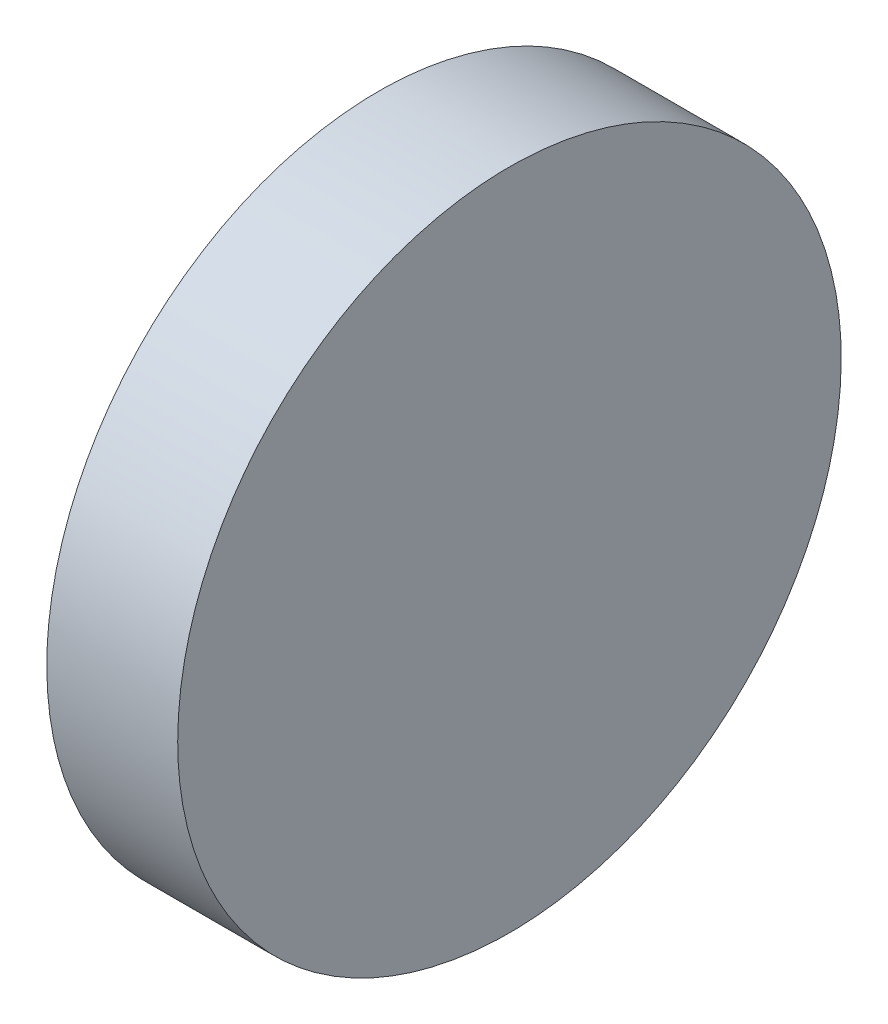
ISO-10303-21;
HEADER;
FILE_DESCRIPTION(('STEP AP214'),'2;1');
FILE_NAME('part.step','',(''),(''),'','','');
FILE_SCHEMA(('AUTOMOTIVE_DESIGN { 1 0 10303 214 1 1 1 1 }'));
ENDSEC;
DATA;
#1=APPLICATION_CONTEXT('core data for automotive mechanical design processes');
#2=APPLICATION_PROTOCOL_DEFINITION('international standard','automotive_design',2000,#1);
#3=PRODUCT_CONTEXT('',#1,'mechanical');
#4=PRODUCT('Part','Part','',(#3));
#5=PRODUCT_RELATED_PRODUCT_CATEGORY('part','',(#4));
#6=PRODUCT_DEFINITION_FORMATION('','',#4);
#7=PRODUCT_DEFINITION_CONTEXT('part definition',#1,'design');
#8=PRODUCT_DEFINITION('design','',#6,#7);
#9=PRODUCT_DEFINITION_SHAPE('','',#8);
#10=(LENGTH_UNIT() NAMED_UNIT(*) SI_UNIT(.MILLI.,.METRE.));
#11=(NAMED_UNIT(*) PLANE_ANGLE_UNIT() SI_UNIT($,.RADIAN.));
#12=(NAMED_UNIT(*) SI_UNIT($,.STERADIAN.) SOLID_ANGLE_UNIT());
#13=UNCERTAINTY_MEASURE_WITH_UNIT(LENGTH_MEASURE(1.E-05),#10,'distance_accuracy_value','');
#14=(GEOMETRIC_REPRESENTATION_CONTEXT(3) GLOBAL_UNCERTAINTY_ASSIGNED_CONTEXT((#13)) GLOBAL_UNIT_ASSIGNED_CONTEXT((#10,
#11,#12)) REPRESENTATION_CONTEXT('',''));
#15=CARTESIAN_POINT('',(0.,0.,0.));
#16=DIRECTION('',(0.,0.,1.));
#17=DIRECTION('',(1.,0.,0.));
#18=AXIS2_PLACEMENT_3D('',#15,#16,#17);
#19=CARTESIAN_POINT('',(25.7111386377281,12.7,-10.2005025253169));
#20=CARTESIAN_POINT('',(25.7111386377281,12.9355219708907,-10.2005025253169));
#21=CARTESIAN_POINT('',(25.7111386377281,13.4065659126721,-10.2941989909165));
#22=CARTESIAN_POINT('',(25.7111386377281,14.0055635701758,-10.6944364298242));
#23=CARTESIAN_POINT('',(25.7111386377281,14.4058010090835,-11.2934340873279));
#24=CARTESIAN_POINT('',(25.7111386377281,14.5463457074828,-12.));
#25=CARTESIAN_POINT('',(25.7111386377281,14.4058010090835,-12.7065659126721));
#26=CARTESIAN_POINT('',(25.7111386377281,14.0055635701758,-13.3055635701758));
#27=CARTESIAN_POINT('',(25.7111386377281,13.4065659126721,-13.7058010090835));
#28=CARTESIAN_POINT('',(25.7111386377281,12.7,-13.8463457074828));
#29=CARTESIAN_POINT('',(25.7111386377281,11.9934340873279,-13.7058010090835));
#30=CARTESIAN_POINT('',(25.7111386377281,11.3944364298242,-13.3055635701758));
#31=CARTESIAN_POINT('',(25.7111386377281,10.9941989909165,-12.7065659126721));
#32=CARTESIAN_POINT('',(25.7111386377281,10.8536542925172,-12.));
#33=CARTESIAN_POINT('',(25.7111386377281,10.9941989909165,-11.2934340873279));
#34=CARTESIAN_POINT('',(25.7111386377281,11.3944364298242,-10.6944364298242));
#35=CARTESIAN_POINT('',(25.7111386377281,11.9934340873279,-10.2941989909165));
#36=CARTESIAN_POINT('',(25.7111386377281,12.4644780291093,-10.2005025253169));
#37=CARTESIAN_POINT('',(25.7111386377281,12.7,-10.2005025253169));
#38=B_SPLINE_CURVE_WITH_KNOTS('',3,(#19,#20,#21,#22,#23,#24,#25,#26,#27,#28,#29,#30,#31,#32,#33,
#34,#35,#36,#37),.UNSPECIFIED.,.T.,.F.,(4,1,1,1,1,1,1,1,1,1,1,1,1,1,1,1,4),(0.,
0.0624999999999998,0.125,0.1875,0.25,0.3125,0.375,0.4375,0.5,0.5625,0.625,0.6875,0.75,0.8125,
0.875,0.9375,1.),.UNSPECIFIED.);
#39=DIRECTION('',(-1.,0.,0.));
#40=VECTOR('',#39,1.);
#41=SURFACE_OF_LINEAR_EXTRUSION('',#38,#40);
#42=CARTESIAN_POINT('',(25.7111386377281,12.7,-10.2005025253169));
#43=CARTESIAN_POINT('',(25.7111386377281,12.9355219708907,-10.2005025253169));
#44=CARTESIAN_POINT('',(25.7111386377281,13.4065659126721,-10.2941989909165));
#45=CARTESIAN_POINT('',(25.7111386377281,14.0055635701758,-10.6944364298242));
#46=CARTESIAN_POINT('',(25.7111386377281,14.4058010090835,-11.2934340873279));
#47=CARTESIAN_POINT('',(25.7111386377281,14.5463457074828,-12.));
#48=CARTESIAN_POINT('',(25.7111386377281,14.4058010090835,-12.7065659126721));
#49=CARTESIAN_POINT('',(25.7111386377281,14.0055635701758,-13.3055635701758));
#50=CARTESIAN_POINT('',(25.7111386377281,13.4065659126721,-13.7058010090835));
#51=CARTESIAN_POINT('',(25.7111386377281,12.7,-13.8463457074828));
#52=CARTESIAN_POINT('',(25.7111386377281,11.9934340873279,-13.7058010090835));
#53=CARTESIAN_POINT('',(25.7111386377281,11.3944364298242,-13.3055635701758));
#54=CARTESIAN_POINT('',(25.7111386377281,10.9941989909165,-12.7065659126721));
#55=CARTESIAN_POINT('',(25.7111386377281,10.8536542925172,-12.));
#56=CARTESIAN_POINT('',(25.7111386377281,10.9941989909165,-11.2934340873279));
#57=CARTESIAN_POINT('',(25.7111386377281,11.3944364298242,-10.6944364298242));
#58=CARTESIAN_POINT('',(25.7111386377281,11.9934340873279,-10.2941989909165));
#59=CARTESIAN_POINT('',(25.7111386377281,12.4644780291093,-10.2005025253169));
#60=CARTESIAN_POINT('',(25.7111386377281,12.7,-10.2005025253169));
#61=B_SPLINE_CURVE_WITH_KNOTS('',3,(#42,#43,#44,#45,#46,#47,#48,#49,#50,#51,#52,#53,#54,#55,#56,
#57,#58,#59,#60),.UNSPECIFIED.,.T.,.F.,(4,1,1,1,1,1,1,1,1,1,1,1,1,1,1,1,4),(0.,
0.0624999999999998,0.125,0.1875,0.25,0.3125,0.375,0.4375,0.5,0.5625,0.625,0.6875,0.75,0.8125,
0.875,0.9375,1.),.UNSPECIFIED.);
#62=CARTESIAN_POINT('',(25.7111386377281,12.7,-10.2005025253169));
#63=VERTEX_POINT('',#62);
#64=EDGE_CURVE('E9',#63,#63,#61,.T.);
#65=ORIENTED_EDGE('',*,*,#64,.T.);
#66=EDGE_LOOP('',(#65));
#67=FACE_BOUND('',#66,.T.);
#68=CARTESIAN_POINT('',(25.001,12.7,-10.2005025253169));
#69=CARTESIAN_POINT('',(25.001,12.6705590589749,-10.200502504003));
#70=CARTESIAN_POINT('',(25.001,12.6411187290328,-10.2012345609489));
#71=CARTESIAN_POINT('',(25.001,12.582308094268,-10.2041486671153));
#72=CARTESIAN_POINT('',(25.001,12.552937793667,-10.2063308016405));
#73=CARTESIAN_POINT('',(25.001,12.4943374905285,-10.212131094405));
#74=CARTESIAN_POINT('',(25.001,12.465107497758,-10.2157493511882));
#75=CARTESIAN_POINT('',(25.001,12.406857659743,-10.2244079695056));
#76=CARTESIAN_POINT('',(25.001,12.3778378236172,-10.2294483923733));
#77=CARTESIAN_POINT('',(25.001,12.3200782743428,-10.2409374801148));
#78=CARTESIAN_POINT('',(25.001,12.2913385611941,-10.2473861449885));
#79=CARTESIAN_POINT('',(25.001,12.2342092070471,-10.2616778787043));
#80=CARTESIAN_POINT('',(25.001,12.2058195510031,-10.2695208873915));
#81=CARTESIAN_POINT('',(25.001,12.1494602997703,-10.2865874585324));
#82=CARTESIAN_POINT('',(25.001,12.1214906758886,-10.2958109262084));
#83=CARTESIAN_POINT('',(25.001,12.0660413837378,-10.315624581653));
#84=CARTESIAN_POINT('',(25.001,12.0385616867419,-10.3262146889863));
#85=CARTESIAN_POINT('',(25.001,11.9841625729701,-10.3487475396828));
#86=CARTESIAN_POINT('',(25.001,11.9572431561942,-10.3606902830459));
#87=CARTESIAN_POINT('',(25.001,11.904024215536,-10.3858884834655));
#88=CARTESIAN_POINT('',(25.001,11.8777247282169,-10.3991440177113));
#89=CARTESIAN_POINT('',(25.001,11.8258048314745,-10.4269281380594));
#90=CARTESIAN_POINT('',(25.001,11.8001844687801,-10.4414568114685));
#91=CARTESIAN_POINT('',(25.001,11.7496821325853,-10.4717475840963));
#92=CARTESIAN_POINT('',(25.001,11.7248001909819,-10.4875097364898));
#93=CARTESIAN_POINT('',(25.001,11.6758340125771,-10.5202278908803));
#94=CARTESIAN_POINT('',(25.001,11.6517497757758,-10.5371838928774));
#95=CARTESIAN_POINT('',(25.001,11.6044383435635,-10.5722501907939));
#96=CARTESIAN_POINT('',(25.001,11.5812111112317,-10.5903604368953));
#97=CARTESIAN_POINT('',(25.001,11.5356730468204,-10.6276956442844));
#98=CARTESIAN_POINT('',(25.001,11.513362151962,-10.6469205289893));
#99=CARTESIAN_POINT('',(25.001,11.4697160434587,-10.6864454851841));
#100=CARTESIAN_POINT('',(25.001,11.4483807724922,-10.7067454933549));
#101=CARTESIAN_POINT('',(25.001,11.4067454933549,-10.7483807724922));
#102=CARTESIAN_POINT('',(25.001,11.3864454851841,-10.7697160434587));
#103=CARTESIAN_POINT('',(25.001,11.3469205289893,-10.813362151962));
#104=CARTESIAN_POINT('',(25.001,11.3276956442844,-10.8356730468204));
#105=CARTESIAN_POINT('',(25.001,11.2903604368953,-10.8812111112317));
#106=CARTESIAN_POINT('',(25.001,11.2722501907939,-10.9044383435635));
#107=CARTESIAN_POINT('',(25.001,11.2371838928774,-10.9517497757758));
#108=CARTESIAN_POINT('',(25.001,11.2202278908803,-10.9758340125772));
#109=CARTESIAN_POINT('',(25.001,11.1875097364898,-11.0248001909818));
#110=CARTESIAN_POINT('',(25.001,11.1717475840963,-11.0496821325851));
#111=CARTESIAN_POINT('',(25.001,11.1414568114685,-11.1001844687803));
#112=CARTESIAN_POINT('',(25.001,11.1269281380594,-11.1258048314752));
#113=CARTESIAN_POINT('',(25.001,11.0991440177113,-11.1777247282162));
#114=CARTESIAN_POINT('',(25.001,11.0858884834653,-11.2040242155335));
#115=CARTESIAN_POINT('',(25.001,11.060690283046,-11.2572431561967));
#116=CARTESIAN_POINT('',(25.001,11.0487475396834,-11.2841625729794));
#117=CARTESIAN_POINT('',(25.001,11.0262146889858,-11.3385616867325));
#118=CARTESIAN_POINT('',(25.001,11.0156245816508,-11.3660413837029));
#119=CARTESIAN_POINT('',(25.001,10.9958109262105,-11.4214906759236));
#120=CARTESIAN_POINT('',(25.001,10.9865874585403,-11.4494602999009));
#121=CARTESIAN_POINT('',(25.001,10.9695208873836,-11.5058195508725));
#122=CARTESIAN_POINT('',(25.001,10.9616778786748,-11.5342092065597));
#123=CARTESIAN_POINT('',(25.001,10.947386145018,-11.5913385616815));
#124=CARTESIAN_POINT('',(25.001,10.9409374802247,-11.6200782761619));
#125=CARTESIAN_POINT('',(25.001,10.9294483922634,-11.6778378217981));
#126=CARTESIAN_POINT('',(25.001,10.9244079690954,-11.7068576529539));
#127=CARTESIAN_POINT('',(25.001,10.9157493515983,-11.7651075045468));
#128=CARTESIAN_POINT('',(25.001,10.9121310959356,-11.794337515864));
#129=CARTESIAN_POINT('',(25.001,10.9063308001101,-11.8529377683333));
#130=CARTESIAN_POINT('',(25.001,10.9041486614037,-11.8823079997243));
#131=CARTESIAN_POINT('',(25.001,10.9012345666601,-11.9411188235709));
#132=CARTESIAN_POINT('',(25.001,10.9005025253169,-11.9705594117854));
#133=CARTESIAN_POINT('',(25.001,10.9005025253169,-12.0294405882146));
#134=CARTESIAN_POINT('',(25.001,10.9012345666601,-12.0588811764291));
#135=CARTESIAN_POINT('',(25.001,10.9041486614037,-12.1176920002757));
#136=CARTESIAN_POINT('',(25.001,10.9063308001101,-12.1470622316667));
#137=CARTESIAN_POINT('',(25.001,10.9121310959356,-12.205662484136));
#138=CARTESIAN_POINT('',(25.001,10.9157493515983,-12.2348924954532));
#139=CARTESIAN_POINT('',(25.001,10.9244079690954,-12.2931423470461));
#140=CARTESIAN_POINT('',(25.001,10.9294483922634,-12.3221621782019));
#141=CARTESIAN_POINT('',(25.001,10.9409374802247,-12.3799217238381));
#142=CARTESIAN_POINT('',(25.001,10.947386145018,-12.4086614383185));
#143=CARTESIAN_POINT('',(25.001,10.9616778786748,-12.4657907934403));
#144=CARTESIAN_POINT('',(25.001,10.9695208873836,-12.4941804491275));
#145=CARTESIAN_POINT('',(25.001,10.9865874585403,-12.5505397000991));
#146=CARTESIAN_POINT('',(25.001,10.9958109262105,-12.5785093240764));
#147=CARTESIAN_POINT('',(25.001,11.0156245816508,-12.6339586162971));
#148=CARTESIAN_POINT('',(25.001,11.0262146889858,-12.6614383132675));
#149=CARTESIAN_POINT('',(25.001,11.0487475396834,-12.7158374270206));
#150=CARTESIAN_POINT('',(25.001,11.060690283046,-12.7427568438033));
#151=CARTESIAN_POINT('',(25.001,11.0858884834653,-12.7959757844665));
#152=CARTESIAN_POINT('',(25.001,11.0991440177113,-12.8222752717838));
#153=CARTESIAN_POINT('',(25.001,11.1269281380594,-12.8741951685248));
#154=CARTESIAN_POINT('',(25.001,11.1414568114685,-12.8998155312197));
#155=CARTESIAN_POINT('',(25.001,11.1717475840963,-12.9503178674149));
#156=CARTESIAN_POINT('',(25.001,11.1875097364898,-12.9751998090182));
#157=CARTESIAN_POINT('',(25.001,11.2202278908803,-13.0241659874228));
#158=CARTESIAN_POINT('',(25.001,11.2371838928774,-13.0482502242242));
#159=CARTESIAN_POINT('',(25.001,11.2722501907939,-13.0955616564365));
#160=CARTESIAN_POINT('',(25.001,11.2903604368953,-13.1187888887683));
#161=CARTESIAN_POINT('',(25.001,11.3276956442844,-13.1643269531796));
#162=CARTESIAN_POINT('',(25.001,11.3469205289893,-13.186637848038));
#163=CARTESIAN_POINT('',(25.001,11.3864454851841,-13.2302839565413));
#164=CARTESIAN_POINT('',(25.001,11.4067454933549,-13.2516192275078));
#165=CARTESIAN_POINT('',(25.001,11.4483807724922,-13.2932545066451));
#166=CARTESIAN_POINT('',(25.001,11.4697160434587,-13.3135545148159));
#167=CARTESIAN_POINT('',(25.001,11.513362151962,-13.3530794710107));
#168=CARTESIAN_POINT('',(25.001,11.5356730468204,-13.3723043557156));
#169=CARTESIAN_POINT('',(25.001,11.5812111112317,-13.4096395631047));
#170=CARTESIAN_POINT('',(25.001,11.6044383435635,-13.4277498092061));
#171=CARTESIAN_POINT('',(25.001,11.6517497757758,-13.4628161071226));
#172=CARTESIAN_POINT('',(25.001,11.6758340125772,-13.4797721091197));
#173=CARTESIAN_POINT('',(25.001,11.7248001909818,-13.5124902635102));
#174=CARTESIAN_POINT('',(25.001,11.7496821325851,-13.5282524159037));
#175=CARTESIAN_POINT('',(25.001,11.8001844687803,-13.5585431885315));
#176=CARTESIAN_POINT('',(25.001,11.8258048314752,-13.5730718619406));
#177=CARTESIAN_POINT('',(25.001,11.8777247282162,-13.6008559822887));
#178=CARTESIAN_POINT('',(25.001,11.9040242155335,-13.6141115165347));
#179=CARTESIAN_POINT('',(25.001,11.9572431561967,-13.639309716954));
#180=CARTESIAN_POINT('',(25.001,11.9841625729794,-13.6512524603166));
#181=CARTESIAN_POINT('',(25.001,12.0385616867325,-13.6737853110142));
#182=CARTESIAN_POINT('',(25.001,12.0660413837029,-13.6843754183492));
#183=CARTESIAN_POINT('',(25.001,12.1214906759236,-13.7041890737895));
#184=CARTESIAN_POINT('',(25.001,12.1494602999009,-13.7134125414597));
#185=CARTESIAN_POINT('',(25.001,12.2058195508725,-13.7304791126164));
#186=CARTESIAN_POINT('',(25.001,12.2342092065597,-13.7383221213252));
#187=CARTESIAN_POINT('',(25.001,12.2913385616815,-13.752613854982));
#188=CARTESIAN_POINT('',(25.001,12.3200782761619,-13.7590625197753));
#189=CARTESIAN_POINT('',(25.001,12.3778378217981,-13.7705516077366));
#190=CARTESIAN_POINT('',(25.001,12.4068576529539,-13.7755920309046));
#191=CARTESIAN_POINT('',(25.001,12.4651075045468,-13.7842506484017));
#192=CARTESIAN_POINT('',(25.001,12.494337515864,-13.7878689040644));
#193=CARTESIAN_POINT('',(25.001,12.5529377683333,-13.7936691998899));
#194=CARTESIAN_POINT('',(25.001,12.5823079997243,-13.7958513385963));
#195=CARTESIAN_POINT('',(25.001,12.6411188235709,-13.7987654333399));
#196=CARTESIAN_POINT('',(25.001,12.6705594117854,-13.7994974746831));
#197=CARTESIAN_POINT('',(25.001,12.7294405882146,-13.7994974746831));
#198=CARTESIAN_POINT('',(25.001,12.7588811764291,-13.7987654333399));
#199=CARTESIAN_POINT('',(25.001,12.8176920002757,-13.7958513385963));
#200=CARTESIAN_POINT('',(25.001,12.8470622316667,-13.7936691998899));
#201=CARTESIAN_POINT('',(25.001,12.905662484136,-13.7878689040644));
#202=CARTESIAN_POINT('',(25.001,12.9348924954532,-13.7842506484017));
#203=CARTESIAN_POINT('',(25.001,12.9931423470461,-13.7755920309046));
#204=CARTESIAN_POINT('',(25.001,13.0221621782019,-13.7705516077366));
#205=CARTESIAN_POINT('',(25.001,13.0799217238381,-13.7590625197753));
#206=CARTESIAN_POINT('',(25.001,13.1086614383184,-13.752613854982));
#207=CARTESIAN_POINT('',(25.001,13.1657907934403,-13.7383221213252));
#208=CARTESIAN_POINT('',(25.001,13.1941804491275,-13.7304791126164));
#209=CARTESIAN_POINT('',(25.001,13.2505397000991,-13.7134125414597));
#210=CARTESIAN_POINT('',(25.001,13.2785093240764,-13.7041890737895));
#211=CARTESIAN_POINT('',(25.001,13.3339586162971,-13.6843754183492));
#212=CARTESIAN_POINT('',(25.001,13.3614383132675,-13.6737853110142));
#213=CARTESIAN_POINT('',(25.001,13.4158374270206,-13.6512524603166));
#214=CARTESIAN_POINT('',(25.001,13.4427568438033,-13.639309716954));
#215=CARTESIAN_POINT('',(25.001,13.4959757844665,-13.6141115165347));
#216=CARTESIAN_POINT('',(25.001,13.5222752717838,-13.6008559822887));
#217=CARTESIAN_POINT('',(25.001,13.5741951685248,-13.5730718619406));
#218=CARTESIAN_POINT('',(25.001,13.5998155312197,-13.5585431885315));
#219=CARTESIAN_POINT('',(25.001,13.6503178674149,-13.5282524159037));
#220=CARTESIAN_POINT('',(25.001,13.6751998090182,-13.5124902635102));
#221=CARTESIAN_POINT('',(25.001,13.7241659874228,-13.4797721091197));
#222=CARTESIAN_POINT('',(25.001,13.7482502242242,-13.4628161071226));
#223=CARTESIAN_POINT('',(25.001,13.7955616564365,-13.4277498092061));
#224=CARTESIAN_POINT('',(25.001,13.8187888887683,-13.4096395631047));
#225=CARTESIAN_POINT('',(25.001,13.8643269531796,-13.3723043557156));
#226=CARTESIAN_POINT('',(25.001,13.886637848038,-13.3530794710107));
#227=CARTESIAN_POINT('',(25.001,13.9302839565413,-13.3135545148159));
#228=CARTESIAN_POINT('',(25.001,13.9516192275078,-13.2932545066451));
#229=CARTESIAN_POINT('',(25.001,13.9932545066451,-13.2516192275078));
#230=CARTESIAN_POINT('',(25.001,14.0135545148159,-13.2302839565413));
#231=CARTESIAN_POINT('',(25.001,14.0530794710107,-13.186637848038));
#232=CARTESIAN_POINT('',(25.001,14.0723043557156,-13.1643269531796));
#233=CARTESIAN_POINT('',(25.001,14.1096395631047,-13.1187888887683));
#234=CARTESIAN_POINT('',(25.001,14.1277498092061,-13.0955616564365));
#235=CARTESIAN_POINT('',(25.001,14.1628161071226,-13.0482502242242));
#236=CARTESIAN_POINT('',(25.001,14.1797721091197,-13.0241659874228));
#237=CARTESIAN_POINT('',(25.001,14.2124902635102,-12.9751998090182));
#238=CARTESIAN_POINT('',(25.001,14.2282524159037,-12.9503178674149));
#239=CARTESIAN_POINT('',(25.001,14.2585431885315,-12.8998155312197));
#240=CARTESIAN_POINT('',(25.001,14.2730718619406,-12.8741951685248));
#241=CARTESIAN_POINT('',(25.001,14.3008559822887,-12.8222752717838));
#242=CARTESIAN_POINT('',(25.001,14.3141115165347,-12.7959757844665));
#243=CARTESIAN_POINT('',(25.001,14.339309716954,-12.7427568438033));
#244=CARTESIAN_POINT('',(25.001,14.3512524603166,-12.7158374270206));
#245=CARTESIAN_POINT('',(25.001,14.3737853110142,-12.6614383132675));
#246=CARTESIAN_POINT('',(25.001,14.3843754183492,-12.6339586162971));
#247=CARTESIAN_POINT('',(25.001,14.4041890737895,-12.5785093240764));
#248=CARTESIAN_POINT('',(25.001,14.4134125414597,-12.5505397000991));
#249=CARTESIAN_POINT('',(25.001,14.4304791126164,-12.4941804491275));
#250=CARTESIAN_POINT('',(25.001,14.4383221213252,-12.4657907934403));
#251=CARTESIAN_POINT('',(25.001,14.452613854982,-12.4086614383185));
#252=CARTESIAN_POINT('',(25.001,14.4590625197753,-12.3799217238381));
#253=CARTESIAN_POINT('',(25.001,14.4705516077366,-12.3221621782019));
#254=CARTESIAN_POINT('',(25.001,14.4755920309046,-12.2931423470461));
#255=CARTESIAN_POINT('',(25.001,14.4842506484017,-12.2348924954532));
#256=CARTESIAN_POINT('',(25.001,14.4878689040644,-12.205662484136));
#257=CARTESIAN_POINT('',(25.001,14.4936691998899,-12.1470622316667));
#258=CARTESIAN_POINT('',(25.001,14.4958513385963,-12.1176920002757));
#259=CARTESIAN_POINT('',(25.001,14.4987654333399,-12.0588811764291));
#260=CARTESIAN_POINT('',(25.001,14.4994974746831,-12.0294405882146));
#261=CARTESIAN_POINT('',(25.001,14.4994974746831,-11.9705594117854));
#262=CARTESIAN_POINT('',(25.001,14.4987654333399,-11.9411188235709));
#263=CARTESIAN_POINT('',(25.001,14.4958513385963,-11.8823079997243));
#264=CARTESIAN_POINT('',(25.001,14.4936691998899,-11.8529377683333));
#265=CARTESIAN_POINT('',(25.001,14.4878689040644,-11.794337515864));
#266=CARTESIAN_POINT('',(25.001,14.4842506484017,-11.7651075045468));
#267=CARTESIAN_POINT('',(25.001,14.4755920309046,-11.7068576529539));
#268=CARTESIAN_POINT('',(25.001,14.4705516077366,-11.6778378217981));
#269=CARTESIAN_POINT('',(25.001,14.4590625197753,-11.6200782761619));
#270=CARTESIAN_POINT('',(25.001,14.452613854982,-11.5913385616815));
#271=CARTESIAN_POINT('',(25.001,14.4383221213252,-11.5342092065597));
#272=CARTESIAN_POINT('',(25.001,14.4304791126164,-11.5058195508725));
#273=CARTESIAN_POINT('',(25.001,14.4134125414597,-11.4494602999009));
#274=CARTESIAN_POINT('',(25.001,14.4041890737895,-11.4214906759236));
#275=CARTESIAN_POINT('',(25.001,14.3843754183491,-11.3660413837029));
#276=CARTESIAN_POINT('',(25.001,14.3737853110142,-11.3385616867325));
#277=CARTESIAN_POINT('',(25.001,14.3512524603166,-11.2841625729794));
#278=CARTESIAN_POINT('',(25.001,14.339309716954,-11.2572431561967));
#279=CARTESIAN_POINT('',(25.001,14.3141115165347,-11.2040242155335));
#280=CARTESIAN_POINT('',(25.001,14.3008559822887,-11.1777247282162));
#281=CARTESIAN_POINT('',(25.001,14.2730718619406,-11.1258048314752));
#282=CARTESIAN_POINT('',(25.001,14.2585431885315,-11.1001844687803));
#283=CARTESIAN_POINT('',(25.001,14.2282524159037,-11.0496821325851));
#284=CARTESIAN_POINT('',(25.001,14.2124902635102,-11.0248001909818));
#285=CARTESIAN_POINT('',(25.001,14.1797721091197,-10.9758340125772));
#286=CARTESIAN_POINT('',(25.001,14.1628161071226,-10.9517497757758));
#287=CARTESIAN_POINT('',(25.001,14.1277498092061,-10.9044383435635));
#288=CARTESIAN_POINT('',(25.001,14.1096395631047,-10.8812111112317));
#289=CARTESIAN_POINT('',(25.001,14.0723043557156,-10.8356730468204));
#290=CARTESIAN_POINT('',(25.001,14.0530794710107,-10.813362151962));
#291=CARTESIAN_POINT('',(25.001,14.0135545148159,-10.7697160434587));
#292=CARTESIAN_POINT('',(25.001,13.9932545066451,-10.7483807724922));
#293=CARTESIAN_POINT('',(25.001,13.9516192275078,-10.7067454933549));
#294=CARTESIAN_POINT('',(25.001,13.9302839565413,-10.6864454851841));
#295=CARTESIAN_POINT('',(25.001,13.886637848038,-10.6469205289893));
#296=CARTESIAN_POINT('',(25.001,13.8643269531796,-10.6276956442844));
#297=CARTESIAN_POINT('',(25.001,13.8187888887683,-10.5903604368953));
#298=CARTESIAN_POINT('',(25.001,13.7955616564365,-10.5722501907939));
#299=CARTESIAN_POINT('',(25.001,13.7482502242242,-10.5371838928774));
#300=CARTESIAN_POINT('',(25.001,13.7241659874229,-10.5202278908803));
#301=CARTESIAN_POINT('',(25.001,13.6751998090181,-10.4875097364898));
#302=CARTESIAN_POINT('',(25.001,13.6503178674147,-10.4717475840963));
#303=CARTESIAN_POINT('',(25.001,13.5998155312199,-10.4414568114685));
#304=CARTESIAN_POINT('',(25.001,13.5741951685255,-10.4269281380594));
#305=CARTESIAN_POINT('',(25.001,13.5222752717831,-10.3991440177113));
#306=CARTESIAN_POINT('',(25.001,13.495975784464,-10.3858884834655));
#307=CARTESIAN_POINT('',(25.001,13.4427568438058,-10.3606902830459));
#308=CARTESIAN_POINT('',(25.001,13.4158374270299,-10.3487475396828));
#309=CARTESIAN_POINT('',(25.001,13.3614383132581,-10.3262146889863));
#310=CARTESIAN_POINT('',(25.001,13.3339586162622,-10.315624581653));
#311=CARTESIAN_POINT('',(25.001,13.2785093241114,-10.2958109262084));
#312=CARTESIAN_POINT('',(25.001,13.2505397002297,-10.2865874585324));
#313=CARTESIAN_POINT('',(25.001,13.1941804489969,-10.2695208873915));
#314=CARTESIAN_POINT('',(25.001,13.1657907929529,-10.2616778787043));
#315=CARTESIAN_POINT('',(25.001,13.1086614388059,-10.2473861449885));
#316=CARTESIAN_POINT('',(25.001,13.0799217256572,-10.2409374801148));
#317=CARTESIAN_POINT('',(25.001,13.0221621763828,-10.2294483923733));
#318=CARTESIAN_POINT('',(25.001,12.993142340257,-10.2244079695056));
#319=CARTESIAN_POINT('',(25.001,12.934892502242,-10.2157493511882));
#320=CARTESIAN_POINT('',(25.001,12.9056625094715,-10.212131094405));
#321=CARTESIAN_POINT('',(25.001,12.847062206333,-10.2063308016405));
#322=CARTESIAN_POINT('',(25.001,12.817691905732,-10.2041486671153));
#323=CARTESIAN_POINT('',(25.001,12.7588812709672,-10.2012345609489));
#324=CARTESIAN_POINT('',(25.001,12.7294409410251,-10.200502504003));
#325=CARTESIAN_POINT('',(25.001,12.7,-10.2005025253169));
#326=B_SPLINE_CURVE_WITH_KNOTS('',3,(#68,#69,#70,#71,#72,#73,#74,#75,#76,#77,#78,#79,#80,#81,
#82,#83,#84,#85,#86,#87,#88,#89,#90,#91,#92,#93,#94,#95,#96,#97,#98,#99,#100,#101,#102,#103,
#104,#105,#106,#107,#108,#109,#110,#111,#112,#113,#114,#115,#116,#117,#118,#119,#120,#121,#122,
#123,#124,#125,#126,#127,#128,#129,#130,#131,#132,#133,#134,#135,#136,#137,#138,#139,#140,#141,
#142,#143,#144,#145,#146,#147,#148,#149,#150,#151,#152,#153,#154,#155,#156,#157,#158,#159,#160,
#161,#162,#163,#164,#165,#166,#167,#168,#169,#170,#171,#172,#173,#174,#175,#176,#177,#178,#179,
#180,#181,#182,#183,#184,#185,#186,#187,#188,#189,#190,#191,#192,#193,#194,#195,#196,#197,#198,
#199,#200,#201,#202,#203,#204,#205,#206,#207,#208,#209,#210,#211,#212,#213,#214,#215,#216,#217,
#218,#219,#220,#221,#222,#223,#224,#225,#226,#227,#228,#229,#230,#231,#232,#233,#234,#235,#236,
#237,#238,#239,#240,#241,#242,#243,#244,#245,#246,#247,#248,#249,#250,#251,#252,#253,#254,#255,
#256,#257,#258,#259,#260,#261,#262,#263,#264,#265,#266,#267,#268,#269,#270,#271,#272,#273,#274,
#275,#276,#277,#278,#279,#280,#281,#282,#283,#284,#285,#286,#287,#288,#289,#290,#291,#292,#293,
#294,#295,#296,#297,#298,#299,#300,#301,#302,#303,#304,#305,#306,#307,#308,#309,#310,#311,#312,
#313,#314,#315,#316,#317,#318,#319,#320,#321,#322,#323,#324,#325),.UNSPECIFIED.,.F.,.F.,(4,2,2,
2,2,2,2,2,2,2,2,2,2,2,2,2,2,2,2,2,2,2,2,2,2,2,2,2,2,2,2,2,2,2,2,2,2,2,2,2,2,2,2,2,2,2,2,2,2,2,2,
2,2,2,2,2,2,2,2,2,2,2,2,2,2,2,2,2,2,2,2,2,2,2,2,2,2,2,2,2,2,2,2,2,2,2,2,2,2,2,2,2,2,2,2,2,2,2,2,
2,2,2,2,2,2,2,2,2,2,2,2,2,2,2,2,2,2,2,2,2,2,2,2,2,2,2,2,2,4),(0.,0.0883128579187113,
0.176630911533427,0.26495502640719,0.353282951002318,0.441610875597449,0.52993499047121,
0.618253044085926,0.706565902004633,0.794878759923346,0.883196813538061,0.971520928411821,
1.05984885300695,1.14817677760208,1.23650089247584,1.32481894609056,1.41313180400927,
1.50144466192798,1.58976271554269,1.67808683041646,1.76641475501158,1.85474267960671,
1.94306679448048,2.03138484809519,2.1196977060139,2.20801056393261,2.29632861754733,
2.38465273242109,2.47298065701622,2.56130858161135,2.64963269648511,2.73795075009982,
2.82626360801853,2.91457646593724,3.00289451955196,3.09121863442572,3.17954655902085,
3.26787448361598,3.35619859848974,3.44451665210446,3.53282951002317,3.62114236794188,
3.70946042155659,3.79778453643035,3.88611246102548,3.97444038562061,4.06276450049438,
4.15108255410909,4.2393954120278,4.32770826994651,4.41602632356122,4.50435043843499,
4.59267836303012,4.68100628762525,4.769330402499,4.85764845611372,4.94596131403243,
5.03427417195114,5.12259222556586,5.21091634043962,5.29924426503475,5.38757218962987,
5.47589630450364,5.56421435811835,5.65252721603706,5.74084007395577,5.82915812757049,
5.91748224244425,6.00581016703938,6.09413809163451,6.18246220650827,6.27078026012299,
6.35909311804169,6.4474059759604,6.53572402957512,6.62404814444889,6.71237606904401,
6.80070399363914,6.8890281085129,6.97734616212762,7.06565902004633,7.15397187796504,
7.24228993157975,7.33061404645351,7.41894197104864,7.50726989564377,7.59559401051753,
7.68391206413225,7.77222492205096,7.86053777996967,7.94885583358438,8.03717994845815,
8.12550787305328,8.21383579764841,8.30215991252217,8.39047796613688,8.4787908240556,
8.56710368197431,8.65542173558902,8.74374585046279,8.83207377505792,8.92040169965304,
9.00872581452681,9.09704386814152,9.18535672606023,9.27366958397894,9.36198763759366,
9.45031175246742,9.53863967706255,9.62696760165768,9.71529171653144,9.80360977014615,
9.89192262806486,9.98023548598357,10.0685535395983,10.156877654472,10.2452055790672,
10.3335335036623,10.4218576185361,10.5101756721508,10.5984885300695,10.6868013879882,
10.7751194416029,10.8634435564767,10.9517714810718,11.0400994056669,11.1284235205407,
11.2167415741554,11.3050544320741),.UNSPECIFIED.);
#327=CARTESIAN_POINT('',(25.001,12.7,-10.2005025253169));
#328=VERTEX_POINT('',#327);
#329=EDGE_CURVE('E24',#328,#328,#326,.F.);
#330=ORIENTED_EDGE('',*,*,#329,.F.);
#331=EDGE_LOOP('',(#330));
#332=FACE_BOUND('',#331,.T.);
#333=ADVANCED_FACE('F14',(#67,#332),#41,.T.);
#334=CARTESIAN_POINT('',(25.7111386377281,39.,0.));
#335=DIRECTION('',(-1.,0.,0.));
#336=DIRECTION('',(0.,-1.,0.));
#337=AXIS2_PLACEMENT_3D('',#334,#335,#336);
#338=PLANE('',#337);
#339=ORIENTED_EDGE('',*,*,#64,.F.);
#340=EDGE_LOOP('',(#339));
#341=FACE_BOUND('',#340,.T.);
#342=ADVANCED_FACE('F62',(#341),#338,.F.);
#343=CARTESIAN_POINT('',(25.001,39.,0.));
#344=DIRECTION('',(-1.,0.,0.));
#345=DIRECTION('',(0.,-1.,0.));
#346=AXIS2_PLACEMENT_3D('',#343,#344,#345);
#347=PLANE('',#346);
#348=ORIENTED_EDGE('',*,*,#329,.T.);
#349=EDGE_LOOP('',(#348));
#350=FACE_BOUND('',#349,.T.);
#351=ADVANCED_FACE('F31',(#350),#347,.T.);
#352=CLOSED_SHELL('',(#333,#342,#351));
#353=MANIFOLD_SOLID_BREP('B1',#352);
#354=ADVANCED_BREP_SHAPE_REPRESENTATION('',(#18,#353),#14);
#355=SHAPE_DEFINITION_REPRESENTATION(#9,#354);
ENDSEC;
END-ISO-10303-21;
